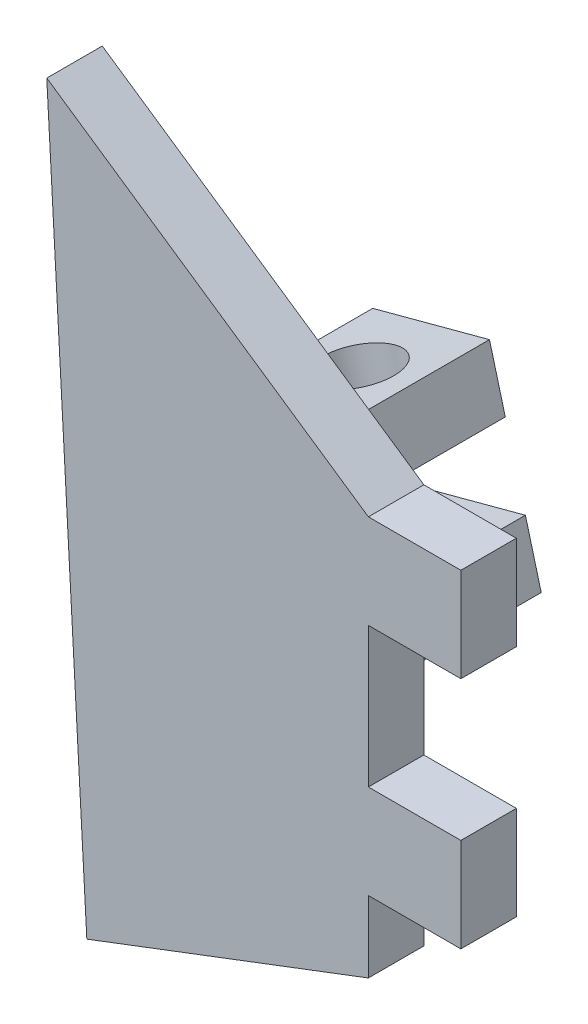
ISO-10303-21;
HEADER;
FILE_DESCRIPTION(('STEP AP214'),'2;1');
FILE_NAME('part.step','',(''),(''),'','','');
FILE_SCHEMA(('AUTOMOTIVE_DESIGN { 1 0 10303 214 1 1 1 1 }'));
ENDSEC;
DATA;
#1=APPLICATION_CONTEXT('core data for automotive mechanical design processes');
#2=APPLICATION_PROTOCOL_DEFINITION('international standard','automotive_design',2000,#1);
#3=PRODUCT_CONTEXT('',#1,'mechanical');
#4=PRODUCT('Part','Part','',(#3));
#5=PRODUCT_RELATED_PRODUCT_CATEGORY('part','',(#4));
#6=PRODUCT_DEFINITION_FORMATION('','',#4);
#7=PRODUCT_DEFINITION_CONTEXT('part definition',#1,'design');
#8=PRODUCT_DEFINITION('design','',#6,#7);
#9=PRODUCT_DEFINITION_SHAPE('','',#8);
#10=(LENGTH_UNIT() NAMED_UNIT(*) SI_UNIT(.MILLI.,.METRE.));
#11=(NAMED_UNIT(*) PLANE_ANGLE_UNIT() SI_UNIT($,.RADIAN.));
#12=(NAMED_UNIT(*) SI_UNIT($,.STERADIAN.) SOLID_ANGLE_UNIT());
#13=UNCERTAINTY_MEASURE_WITH_UNIT(LENGTH_MEASURE(1.E-05),#10,'distance_accuracy_value','');
#14=(GEOMETRIC_REPRESENTATION_CONTEXT(3) GLOBAL_UNCERTAINTY_ASSIGNED_CONTEXT((#13)) GLOBAL_UNIT_ASSIGNED_CONTEXT((#10,
#11,#12)) REPRESENTATION_CONTEXT('',''));
#15=CARTESIAN_POINT('',(0.,0.,0.));
#16=DIRECTION('',(0.,0.,1.));
#17=DIRECTION('',(1.,0.,0.));
#18=AXIS2_PLACEMENT_3D('',#15,#16,#17);
#19=CARTESIAN_POINT('',(0.,0.,0.));
#20=DIRECTION('',(0.,0.,1.));
#21=DIRECTION('',(1.,0.,0.));
#22=AXIS2_PLACEMENT_3D('',#19,#20,#21);
#23=PLANE('',#22);
#24=DIRECTION('',(-0.965925826289069,-0.258819045102518,0.));
#25=VECTOR('',#24,1.);
#26=CARTESIAN_POINT('',(1.3093957835521,29.6760159048987,0.));
#27=LINE('',#26,#25);
#28=CARTESIAN_POINT('',(7.62203706146039,31.3674830374216,0.));
#29=VERTEX_POINT('',#28);
#30=CARTESIAN_POINT('',(1.3093957835521,29.6760159048987,0.));
#31=VERTEX_POINT('',#30);
#32=EDGE_CURVE('E189',#29,#31,#27,.T.);
#33=ORIENTED_EDGE('',*,*,#32,.F.);
#34=DIRECTION('',(0.258819045102518,-0.965925826289069,0.));
#35=VECTOR('',#34,1.);
#36=CARTESIAN_POINT('',(7.62203706146039,31.3674830374216,0.));
#37=LINE('',#36,#35);
#38=CARTESIAN_POINT('',(6.76661925482987,34.5599457534659,0.));
#39=VERTEX_POINT('',#38);
#40=EDGE_CURVE('E202',#39,#29,#37,.T.);
#41=ORIENTED_EDGE('',*,*,#40,.F.);
#42=DIRECTION('',(0.965925826289069,0.258819045102518,0.));
#43=VECTOR('',#42,1.);
#44=CARTESIAN_POINT('',(6.76661925482987,34.5599457534659,0.));
#45=LINE('',#44,#43);
#46=CARTESIAN_POINT('',(0.453977976921569,32.868478620943,0.));
#47=VERTEX_POINT('',#46);
#48=EDGE_CURVE('E211',#47,#39,#45,.T.);
#49=ORIENTED_EDGE('',*,*,#48,.F.);
#50=DIRECTION('',(-0.258819045102518,0.965925826289069,0.));
#51=VECTOR('',#50,1.);
#52=CARTESIAN_POINT('',(0.453977976921569,32.868478620943,0.));
#53=LINE('',#52,#51);
#54=EDGE_CURVE('E192',#31,#47,#53,.T.);
#55=ORIENTED_EDGE('',*,*,#54,.F.);
#56=EDGE_LOOP('',(#33,#41,#49,#55));
#57=FACE_BOUND('',#56,.T.);
#58=DIRECTION('',(-0.826285867001077,0.563250979576847,0.));
#59=VECTOR('',#58,1.);
#60=CARTESIAN_POINT('',(15.2195193965159,37.9893515063543,0.));
#61=LINE('',#60,#59);
#62=CARTESIAN_POINT('',(15.2195193965159,37.9893515063543,0.));
#63=VERTEX_POINT('',#62);
#64=CARTESIAN_POINT('',(-2.16597928326462,49.8404548023103,0.));
#65=VERTEX_POINT('',#64);
#66=EDGE_CURVE('E227',#63,#65,#61,.T.);
#67=ORIENTED_EDGE('',*,*,#66,.F.);
#68=DIRECTION('',(-1.,0.,0.));
#69=VECTOR('',#68,1.);
#70=CARTESIAN_POINT('',(15.2195193965159,37.9893515063543,0.));
#71=LINE('',#70,#69);
#72=CARTESIAN_POINT('',(20.2195193965159,37.9893515063543,0.));
#73=VERTEX_POINT('',#72);
#74=EDGE_CURVE('E232',#73,#63,#71,.T.);
#75=ORIENTED_EDGE('',*,*,#74,.F.);
#76=DIRECTION('',(0.,1.,0.));
#77=VECTOR('',#76,1.);
#78=CARTESIAN_POINT('',(20.2195193965159,37.9893515063543,0.));
#79=LINE('',#78,#77);
#80=CARTESIAN_POINT('',(20.2195193965159,32.9093515063543,0.));
#81=VERTEX_POINT('',#80);
#82=EDGE_CURVE('E271',#81,#73,#79,.T.);
#83=ORIENTED_EDGE('',*,*,#82,.F.);
#84=DIRECTION('',(1.,0.,0.));
#85=VECTOR('',#84,1.);
#86=CARTESIAN_POINT('',(15.2195193965159,32.9093515063543,0.));
#87=LINE('',#86,#85);
#88=CARTESIAN_POINT('',(15.2195193965159,32.9093515063543,0.));
#89=VERTEX_POINT('',#88);
#90=EDGE_CURVE('E269',#89,#81,#87,.T.);
#91=ORIENTED_EDGE('',*,*,#90,.F.);
#92=DIRECTION('',(0.,1.,0.));
#93=VECTOR('',#92,1.);
#94=CARTESIAN_POINT('',(15.2195193965159,32.9093515063543,0.));
#95=LINE('',#94,#93);
#96=CARTESIAN_POINT('',(15.2195193965159,25.3411570874817,0.));
#97=VERTEX_POINT('',#96);
#98=EDGE_CURVE('E267',#97,#89,#95,.T.);
#99=ORIENTED_EDGE('',*,*,#98,.F.);
#100=DIRECTION('',(-1.,0.,0.));
#101=VECTOR('',#100,1.);
#102=CARTESIAN_POINT('',(15.2195193965159,25.3411570874817,0.));
#103=LINE('',#102,#101);
#104=CARTESIAN_POINT('',(20.2195193965159,25.3411570874817,0.));
#105=VERTEX_POINT('',#104);
#106=EDGE_CURVE('E265',#105,#97,#103,.T.);
#107=ORIENTED_EDGE('',*,*,#106,.F.);
#108=DIRECTION('',(0.,1.,0.));
#109=VECTOR('',#108,1.);
#110=CARTESIAN_POINT('',(20.2195193965159,25.3411570874817,0.));
#111=LINE('',#110,#109);
#112=CARTESIAN_POINT('',(20.2195193965159,20.2611570874817,0.));
#113=VERTEX_POINT('',#112);
#114=EDGE_CURVE('E263',#113,#105,#111,.T.);
#115=ORIENTED_EDGE('',*,*,#114,.F.);
#116=DIRECTION('',(1.,0.,0.));
#117=VECTOR('',#116,1.);
#118=CARTESIAN_POINT('',(15.2195193965159,20.2611570874817,0.));
#119=LINE('',#118,#117);
#120=CARTESIAN_POINT('',(15.2195193965159,20.2611570874817,0.));
#121=VERTEX_POINT('',#120);
#122=EDGE_CURVE('E261',#121,#113,#119,.T.);
#123=ORIENTED_EDGE('',*,*,#122,.F.);
#124=DIRECTION('',(0.,1.,0.));
#125=VECTOR('',#124,1.);
#126=CARTESIAN_POINT('',(15.2195193965159,20.2611570874817,0.));
#127=LINE('',#126,#125);
#128=CARTESIAN_POINT('',(15.2195193965159,16.3993515063543,0.));
#129=VERTEX_POINT('',#128);
#130=EDGE_CURVE('E259',#129,#121,#127,.T.);
#131=ORIENTED_EDGE('',*,*,#130,.F.);
#132=DIRECTION('',(0.934655278359338,0.355555214608123,0.));
#133=VECTOR('',#132,1.);
#134=CARTESIAN_POINT('',(15.2195193965159,16.3993515063543,0.));
#135=LINE('',#134,#133);
#136=CARTESIAN_POINT('',(0.,10.6096452793059,0.));
#137=VERTEX_POINT('',#136);
#138=EDGE_CURVE('E257',#137,#129,#135,.T.);
#139=ORIENTED_EDGE('',*,*,#138,.F.);
#140=DIRECTION('',(0.0551272224098083,-0.998479338468944,0.));
#141=VECTOR('',#140,1.);
#142=CARTESIAN_POINT('',(-2.16597928326462,49.8404548023103,0.));
#143=LINE('',#142,#141);
#144=EDGE_CURVE('E255',#65,#137,#143,.T.);
#145=ORIENTED_EDGE('',*,*,#144,.F.);
#146=EDGE_LOOP('',(#67,#75,#83,#91,#99,#107,#115,#123,#131,#139,#145));
#147=FACE_BOUND('',#146,.T.);
#148=DIRECTION('',(0.258819045102517,-0.965925826289069,0.));
#149=VECTOR('',#148,1.);
#150=CARTESIAN_POINT('',(8.70907705089096,27.3105945670075,0.));
#151=LINE('',#150,#149);
#152=CARTESIAN_POINT('',(8.70907705089096,27.3105945670075,0.));
#153=VERTEX_POINT('',#152);
#154=CARTESIAN_POINT('',(9.56449485752149,24.1181318509632,0.));
#155=VERTEX_POINT('',#154);
#156=EDGE_CURVE('E188',#153,#155,#151,.T.);
#157=ORIENTED_EDGE('',*,*,#156,.F.);
#158=DIRECTION('',(0.965925826289069,0.258819045102518,0.));
#159=VECTOR('',#158,1.);
#160=CARTESIAN_POINT('',(8.70907705089096,27.3105945670075,0.));
#161=LINE('',#160,#159);
#162=CARTESIAN_POINT('',(2.39643577298267,25.6191274344846,0.));
#163=VERTEX_POINT('',#162);
#164=EDGE_CURVE('E185',#163,#153,#161,.T.);
#165=ORIENTED_EDGE('',*,*,#164,.F.);
#166=DIRECTION('',(-0.258819045102518,0.965925826289069,0.));
#167=VECTOR('',#166,1.);
#168=CARTESIAN_POINT('',(2.39643577298267,25.6191274344846,0.));
#169=LINE('',#168,#167);
#170=CARTESIAN_POINT('',(3.2518535796132,22.4266647184403,0.));
#171=VERTEX_POINT('',#170);
#172=EDGE_CURVE('E57',#171,#163,#169,.T.);
#173=ORIENTED_EDGE('',*,*,#172,.F.);
#174=DIRECTION('',(-0.965925826289069,-0.258819045102518,0.));
#175=VECTOR('',#174,1.);
#176=CARTESIAN_POINT('',(3.2518535796132,22.4266647184403,0.));
#177=LINE('',#176,#175);
#178=EDGE_CURVE('E52',#155,#171,#177,.T.);
#179=ORIENTED_EDGE('',*,*,#178,.F.);
#180=EDGE_LOOP('',(#157,#165,#173,#179));
#181=FACE_BOUND('',#180,.T.);
#182=ADVANCED_FACE('F36',(#57,#147,#181),#23,.F.);
#183=CARTESIAN_POINT('',(15.2195193965159,37.9893515063543,3.));
#184=DIRECTION('',(-0.563250979576847,-0.826285867001077,0.));
#185=DIRECTION('',(0.826285867001077,-0.563250979576847,0.));
#186=AXIS2_PLACEMENT_3D('',#183,#184,#185);
#187=PLANE('',#186);
#188=ORIENTED_EDGE('',*,*,#66,.T.);
#189=DIRECTION('',(0.,0.,-1.));
#190=VECTOR('',#189,1.);
#191=CARTESIAN_POINT('',(-2.16597928326462,49.8404548023103,3.));
#192=LINE('',#191,#190);
#193=CARTESIAN_POINT('',(-2.16597928326462,49.8404548023103,3.));
#194=VERTEX_POINT('',#193);
#195=EDGE_CURVE('E11',#194,#65,#192,.T.);
#196=ORIENTED_EDGE('',*,*,#195,.F.);
#197=DIRECTION('',(-0.826285867001077,0.563250979576847,0.));
#198=VECTOR('',#197,1.);
#199=CARTESIAN_POINT('',(15.2195193965159,37.9893515063543,3.));
#200=LINE('',#199,#198);
#201=CARTESIAN_POINT('',(15.2195193965159,37.9893515063543,3.));
#202=VERTEX_POINT('',#201);
#203=EDGE_CURVE('E228',#202,#194,#200,.T.);
#204=ORIENTED_EDGE('',*,*,#203,.F.);
#205=DIRECTION('',(0.,0.,-1.));
#206=VECTOR('',#205,1.);
#207=CARTESIAN_POINT('',(15.2195193965159,37.9893515063543,3.));
#208=LINE('',#207,#206);
#209=EDGE_CURVE('E252',#202,#63,#208,.T.);
#210=ORIENTED_EDGE('',*,*,#209,.T.);
#211=EDGE_LOOP('',(#188,#196,#204,#210));
#212=FACE_BOUND('',#211,.T.);
#213=ADVANCED_FACE('F38',(#212),#187,.F.);
#214=CARTESIAN_POINT('',(-2.16597928326462,49.8404548023103,3.));
#215=DIRECTION('',(0.998479338468944,0.0551272224098083,0.));
#216=DIRECTION('',(-0.0551272224098083,0.998479338468944,0.));
#217=AXIS2_PLACEMENT_3D('',#214,#215,#216);
#218=PLANE('',#217);
#219=ORIENTED_EDGE('',*,*,#144,.T.);
#220=DIRECTION('',(0.,0.,-1.));
#221=VECTOR('',#220,1.);
#222=CARTESIAN_POINT('',(0.,10.6096452793059,3.));
#223=LINE('',#222,#221);
#224=CARTESIAN_POINT('',(0.,10.6096452793059,3.));
#225=VERTEX_POINT('',#224);
#226=EDGE_CURVE('E45',#225,#137,#223,.T.);
#227=ORIENTED_EDGE('',*,*,#226,.F.);
#228=DIRECTION('',(0.0551272224098083,-0.998479338468944,0.));
#229=VECTOR('',#228,1.);
#230=CARTESIAN_POINT('',(-2.16597928326462,49.8404548023103,3.));
#231=LINE('',#230,#229);
#232=EDGE_CURVE('E231',#194,#225,#231,.T.);
#233=ORIENTED_EDGE('',*,*,#232,.F.);
#234=ORIENTED_EDGE('',*,*,#195,.T.);
#235=EDGE_LOOP('',(#219,#227,#233,#234));
#236=FACE_BOUND('',#235,.T.);
#237=ADVANCED_FACE('F327',(#236),#218,.F.);
#238=CARTESIAN_POINT('',(15.2195193965159,16.3993515063543,3.));
#239=DIRECTION('',(-0.355555214608123,0.934655278359338,0.));
#240=DIRECTION('',(-0.934655278359338,-0.355555214608123,0.));
#241=AXIS2_PLACEMENT_3D('',#238,#239,#240);
#242=PLANE('',#241);
#243=ORIENTED_EDGE('',*,*,#138,.T.);
#244=DIRECTION('',(0.,0.,-1.));
#245=VECTOR('',#244,1.);
#246=CARTESIAN_POINT('',(15.2195193965159,16.3993515063543,3.));
#247=LINE('',#246,#245);
#248=CARTESIAN_POINT('',(15.2195193965159,16.3993515063543,3.));
#249=VERTEX_POINT('',#248);
#250=EDGE_CURVE('E297',#249,#129,#247,.T.);
#251=ORIENTED_EDGE('',*,*,#250,.F.);
#252=DIRECTION('',(0.934655278359338,0.355555214608123,0.));
#253=VECTOR('',#252,1.);
#254=CARTESIAN_POINT('',(15.2195193965159,16.3993515063543,3.));
#255=LINE('',#254,#253);
#256=EDGE_CURVE('E234',#225,#249,#255,.T.);
#257=ORIENTED_EDGE('',*,*,#256,.F.);
#258=ORIENTED_EDGE('',*,*,#226,.T.);
#259=EDGE_LOOP('',(#243,#251,#257,#258));
#260=FACE_BOUND('',#259,.T.);
#261=ADVANCED_FACE('F305',(#260),#242,.F.);
#262=CARTESIAN_POINT('',(15.2195193965159,20.2611570874817,3.));
#263=DIRECTION('',(-1.,0.,0.));
#264=DIRECTION('',(0.,0.,1.));
#265=AXIS2_PLACEMENT_3D('',#262,#263,#264);
#266=PLANE('',#265);
#267=ORIENTED_EDGE('',*,*,#130,.T.);
#268=DIRECTION('',(0.,0.,-1.));
#269=VECTOR('',#268,1.);
#270=CARTESIAN_POINT('',(15.2195193965159,20.2611570874817,3.));
#271=LINE('',#270,#269);
#272=CARTESIAN_POINT('',(15.2195193965159,20.2611570874817,3.));
#273=VERTEX_POINT('',#272);
#274=EDGE_CURVE('E294',#273,#121,#271,.T.);
#275=ORIENTED_EDGE('',*,*,#274,.F.);
#276=DIRECTION('',(0.,1.,0.));
#277=VECTOR('',#276,1.);
#278=CARTESIAN_POINT('',(15.2195193965159,20.2611570874817,3.));
#279=LINE('',#278,#277);
#280=EDGE_CURVE('E236',#249,#273,#279,.T.);
#281=ORIENTED_EDGE('',*,*,#280,.F.);
#282=ORIENTED_EDGE('',*,*,#250,.T.);
#283=EDGE_LOOP('',(#267,#275,#281,#282));
#284=FACE_BOUND('',#283,.T.);
#285=ADVANCED_FACE('F315',(#284),#266,.F.);
#286=CARTESIAN_POINT('',(15.2195193965159,20.2611570874817,3.));
#287=DIRECTION('',(0.,1.,0.));
#288=DIRECTION('',(0.,0.,1.));
#289=AXIS2_PLACEMENT_3D('',#286,#287,#288);
#290=PLANE('',#289);
#291=ORIENTED_EDGE('',*,*,#122,.T.);
#292=DIRECTION('',(0.,0.,-1.));
#293=VECTOR('',#292,1.);
#294=CARTESIAN_POINT('',(20.2195193965159,20.2611570874817,3.));
#295=LINE('',#294,#293);
#296=CARTESIAN_POINT('',(20.2195193965159,20.2611570874817,3.));
#297=VERTEX_POINT('',#296);
#298=EDGE_CURVE('E291',#297,#113,#295,.T.);
#299=ORIENTED_EDGE('',*,*,#298,.F.);
#300=DIRECTION('',(1.,0.,0.));
#301=VECTOR('',#300,1.);
#302=CARTESIAN_POINT('',(15.2195193965159,20.2611570874817,3.));
#303=LINE('',#302,#301);
#304=EDGE_CURVE('E238',#273,#297,#303,.T.);
#305=ORIENTED_EDGE('',*,*,#304,.F.);
#306=ORIENTED_EDGE('',*,*,#274,.T.);
#307=EDGE_LOOP('',(#291,#299,#305,#306));
#308=FACE_BOUND('',#307,.T.);
#309=ADVANCED_FACE('F319',(#308),#290,.F.);
#310=CARTESIAN_POINT('',(20.2195193965159,25.3411570874817,3.));
#311=DIRECTION('',(-1.,0.,0.));
#312=DIRECTION('',(0.,0.,1.));
#313=AXIS2_PLACEMENT_3D('',#310,#311,#312);
#314=PLANE('',#313);
#315=ORIENTED_EDGE('',*,*,#114,.T.);
#316=DIRECTION('',(0.,0.,-1.));
#317=VECTOR('',#316,1.);
#318=CARTESIAN_POINT('',(20.2195193965159,25.3411570874817,3.));
#319=LINE('',#318,#317);
#320=CARTESIAN_POINT('',(20.2195193965159,25.3411570874817,3.));
#321=VERTEX_POINT('',#320);
#322=EDGE_CURVE('E288',#321,#105,#319,.T.);
#323=ORIENTED_EDGE('',*,*,#322,.F.);
#324=DIRECTION('',(0.,1.,0.));
#325=VECTOR('',#324,1.);
#326=CARTESIAN_POINT('',(20.2195193965159,25.3411570874817,3.));
#327=LINE('',#326,#325);
#328=EDGE_CURVE('E240',#297,#321,#327,.T.);
#329=ORIENTED_EDGE('',*,*,#328,.F.);
#330=ORIENTED_EDGE('',*,*,#298,.T.);
#331=EDGE_LOOP('',(#315,#323,#329,#330));
#332=FACE_BOUND('',#331,.T.);
#333=ADVANCED_FACE('F355',(#332),#314,.F.);
#334=CARTESIAN_POINT('',(15.2195193965159,25.3411570874817,3.));
#335=DIRECTION('',(0.,-1.,0.));
#336=DIRECTION('',(0.,0.,-1.));
#337=AXIS2_PLACEMENT_3D('',#334,#335,#336);
#338=PLANE('',#337);
#339=ORIENTED_EDGE('',*,*,#106,.T.);
#340=DIRECTION('',(0.,0.,-1.));
#341=VECTOR('',#340,1.);
#342=CARTESIAN_POINT('',(15.2195193965159,25.3411570874817,3.));
#343=LINE('',#342,#341);
#344=CARTESIAN_POINT('',(15.2195193965159,25.3411570874817,3.));
#345=VERTEX_POINT('',#344);
#346=EDGE_CURVE('E285',#345,#97,#343,.T.);
#347=ORIENTED_EDGE('',*,*,#346,.F.);
#348=DIRECTION('',(-1.,0.,0.));
#349=VECTOR('',#348,1.);
#350=CARTESIAN_POINT('',(15.2195193965159,25.3411570874817,3.));
#351=LINE('',#350,#349);
#352=EDGE_CURVE('E242',#321,#345,#351,.T.);
#353=ORIENTED_EDGE('',*,*,#352,.F.);
#354=ORIENTED_EDGE('',*,*,#322,.T.);
#355=EDGE_LOOP('',(#339,#347,#353,#354));
#356=FACE_BOUND('',#355,.T.);
#357=ADVANCED_FACE('F353',(#356),#338,.F.);
#358=CARTESIAN_POINT('',(15.2195193965159,32.9093515063543,3.));
#359=DIRECTION('',(-1.,0.,0.));
#360=DIRECTION('',(0.,0.,1.));
#361=AXIS2_PLACEMENT_3D('',#358,#359,#360);
#362=PLANE('',#361);
#363=ORIENTED_EDGE('',*,*,#98,.T.);
#364=DIRECTION('',(0.,0.,-1.));
#365=VECTOR('',#364,1.);
#366=CARTESIAN_POINT('',(15.2195193965159,32.9093515063543,3.));
#367=LINE('',#366,#365);
#368=CARTESIAN_POINT('',(15.2195193965159,32.9093515063543,3.));
#369=VERTEX_POINT('',#368);
#370=EDGE_CURVE('E282',#369,#89,#367,.T.);
#371=ORIENTED_EDGE('',*,*,#370,.F.);
#372=DIRECTION('',(0.,1.,0.));
#373=VECTOR('',#372,1.);
#374=CARTESIAN_POINT('',(15.2195193965159,32.9093515063543,3.));
#375=LINE('',#374,#373);
#376=EDGE_CURVE('E244',#345,#369,#375,.T.);
#377=ORIENTED_EDGE('',*,*,#376,.F.);
#378=ORIENTED_EDGE('',*,*,#346,.T.);
#379=EDGE_LOOP('',(#363,#371,#377,#378));
#380=FACE_BOUND('',#379,.T.);
#381=ADVANCED_FACE('F348',(#380),#362,.F.);
#382=CARTESIAN_POINT('',(15.2195193965159,32.9093515063543,3.));
#383=DIRECTION('',(0.,1.,0.));
#384=DIRECTION('',(0.,0.,1.));
#385=AXIS2_PLACEMENT_3D('',#382,#383,#384);
#386=PLANE('',#385);
#387=ORIENTED_EDGE('',*,*,#90,.T.);
#388=DIRECTION('',(0.,0.,-1.));
#389=VECTOR('',#388,1.);
#390=CARTESIAN_POINT('',(20.2195193965159,32.9093515063543,3.));
#391=LINE('',#390,#389);
#392=CARTESIAN_POINT('',(20.2195193965159,32.9093515063543,3.));
#393=VERTEX_POINT('',#392);
#394=EDGE_CURVE('E279',#393,#81,#391,.T.);
#395=ORIENTED_EDGE('',*,*,#394,.F.);
#396=DIRECTION('',(1.,0.,0.));
#397=VECTOR('',#396,1.);
#398=CARTESIAN_POINT('',(15.2195193965159,32.9093515063543,3.));
#399=LINE('',#398,#397);
#400=EDGE_CURVE('E246',#369,#393,#399,.T.);
#401=ORIENTED_EDGE('',*,*,#400,.F.);
#402=ORIENTED_EDGE('',*,*,#370,.T.);
#403=EDGE_LOOP('',(#387,#395,#401,#402));
#404=FACE_BOUND('',#403,.T.);
#405=ADVANCED_FACE('F343',(#404),#386,.F.);
#406=CARTESIAN_POINT('',(20.2195193965159,37.9893515063543,3.));
#407=DIRECTION('',(-1.,0.,0.));
#408=DIRECTION('',(0.,0.,1.));
#409=AXIS2_PLACEMENT_3D('',#406,#407,#408);
#410=PLANE('',#409);
#411=ORIENTED_EDGE('',*,*,#82,.T.);
#412=DIRECTION('',(0.,0.,-1.));
#413=VECTOR('',#412,1.);
#414=CARTESIAN_POINT('',(20.2195193965159,37.9893515063543,3.));
#415=LINE('',#414,#413);
#416=CARTESIAN_POINT('',(20.2195193965159,37.9893515063543,3.));
#417=VERTEX_POINT('',#416);
#418=EDGE_CURVE('E276',#417,#73,#415,.T.);
#419=ORIENTED_EDGE('',*,*,#418,.F.);
#420=DIRECTION('',(0.,1.,0.));
#421=VECTOR('',#420,1.);
#422=CARTESIAN_POINT('',(20.2195193965159,37.9893515063543,3.));
#423=LINE('',#422,#421);
#424=EDGE_CURVE('E248',#393,#417,#423,.T.);
#425=ORIENTED_EDGE('',*,*,#424,.F.);
#426=ORIENTED_EDGE('',*,*,#394,.T.);
#427=EDGE_LOOP('',(#411,#419,#425,#426));
#428=FACE_BOUND('',#427,.T.);
#429=ADVANCED_FACE('F339',(#428),#410,.F.);
#430=CARTESIAN_POINT('',(15.2195193965159,37.9893515063543,3.));
#431=DIRECTION('',(0.,-1.,0.));
#432=DIRECTION('',(0.,0.,-1.));
#433=AXIS2_PLACEMENT_3D('',#430,#431,#432);
#434=PLANE('',#433);
#435=ORIENTED_EDGE('',*,*,#74,.T.);
#436=ORIENTED_EDGE('',*,*,#209,.F.);
#437=DIRECTION('',(-1.,0.,0.));
#438=VECTOR('',#437,1.);
#439=CARTESIAN_POINT('',(15.2195193965159,37.9893515063543,3.));
#440=LINE('',#439,#438);
#441=EDGE_CURVE('E250',#417,#202,#440,.T.);
#442=ORIENTED_EDGE('',*,*,#441,.F.);
#443=ORIENTED_EDGE('',*,*,#418,.T.);
#444=EDGE_LOOP('',(#435,#436,#442,#443));
#445=FACE_BOUND('',#444,.T.);
#446=ADVANCED_FACE('F334',(#445),#434,.F.);
#447=CARTESIAN_POINT('',(0.,0.,3.));
#448=DIRECTION('',(0.,0.,1.));
#449=DIRECTION('',(1.,0.,0.));
#450=AXIS2_PLACEMENT_3D('',#447,#448,#449);
#451=PLANE('',#450);
#452=ORIENTED_EDGE('',*,*,#203,.T.);
#453=ORIENTED_EDGE('',*,*,#232,.T.);
#454=ORIENTED_EDGE('',*,*,#256,.T.);
#455=ORIENTED_EDGE('',*,*,#280,.T.);
#456=ORIENTED_EDGE('',*,*,#304,.T.);
#457=ORIENTED_EDGE('',*,*,#328,.T.);
#458=ORIENTED_EDGE('',*,*,#352,.T.);
#459=ORIENTED_EDGE('',*,*,#376,.T.);
#460=ORIENTED_EDGE('',*,*,#400,.T.);
#461=ORIENTED_EDGE('',*,*,#424,.T.);
#462=ORIENTED_EDGE('',*,*,#441,.T.);
#463=EDGE_LOOP('',(#452,#453,#454,#455,#456,#457,#458,#459,#460,#461,#462));
#464=FACE_BOUND('',#463,.T.);
#465=ADVANCED_FACE('F323',(#464),#451,.T.);
#466=CARTESIAN_POINT('',(1.3093957835521,29.6760159048987,-12.));
#467=DIRECTION('',(-0.258819045102518,0.965925826289069,0.));
#468=DIRECTION('',(-0.965925826289069,-0.258819045102518,0.));
#469=AXIS2_PLACEMENT_3D('',#466,#467,#468);
#470=PLANE('',#469);
#471=CARTESIAN_POINT('',(4.46571642250624,30.5217494711601,-8.04439772308612));
#472=DIRECTION('',(-0.258819045102518,0.965925826289069,0.));
#473=DIRECTION('',(-0.965925826289069,-0.258819045102518,0.));
#474=AXIS2_PLACEMENT_3D('',#471,#472,#473);
#475=CIRCLE('',#474,2.);
#476=CARTESIAN_POINT('',(2.53386476992811,30.0041113809551,-8.04439772308612));
#477=VERTEX_POINT('',#476);
#478=EDGE_CURVE('E579',#477,#477,#475,.T.);
#479=ORIENTED_EDGE('',*,*,#478,.T.);
#480=EDGE_LOOP('',(#479));
#481=FACE_BOUND('',#480,.T.);
#482=ORIENTED_EDGE('',*,*,#32,.T.);
#483=DIRECTION('',(0.,0.,1.));
#484=VECTOR('',#483,1.);
#485=CARTESIAN_POINT('',(1.3093957835521,29.6760159048987,-12.));
#486=LINE('',#485,#484);
#487=CARTESIAN_POINT('',(1.3093957835521,29.6760159048987,-12.));
#488=VERTEX_POINT('',#487);
#489=EDGE_CURVE('E224',#488,#31,#486,.T.);
#490=ORIENTED_EDGE('',*,*,#489,.F.);
#491=DIRECTION('',(-0.965925826289069,-0.258819045102518,0.));
#492=VECTOR('',#491,1.);
#493=CARTESIAN_POINT('',(1.3093957835521,29.6760159048987,-12.));
#494=LINE('',#493,#492);
#495=CARTESIAN_POINT('',(7.62203706146039,31.3674830374216,-12.));
#496=VERTEX_POINT('',#495);
#497=EDGE_CURVE('E198',#496,#488,#494,.T.);
#498=ORIENTED_EDGE('',*,*,#497,.F.);
#499=DIRECTION('',(0.,0.,1.));
#500=VECTOR('',#499,1.);
#501=CARTESIAN_POINT('',(7.62203706146039,31.3674830374216,-12.));
#502=LINE('',#501,#500);
#503=EDGE_CURVE('E207',#496,#29,#502,.T.);
#504=ORIENTED_EDGE('',*,*,#503,.T.);
#505=EDGE_LOOP('',(#482,#490,#498,#504));
#506=FACE_BOUND('',#505,.T.);
#507=ADVANCED_FACE('F402',(#481,#506),#470,.F.);
#508=CARTESIAN_POINT('',(0.453977976921569,32.868478620943,-12.));
#509=DIRECTION('',(0.965925826289069,0.258819045102518,0.));
#510=DIRECTION('',(-0.258819045102518,0.965925826289069,0.));
#511=AXIS2_PLACEMENT_3D('',#508,#509,#510);
#512=PLANE('',#511);
#513=ORIENTED_EDGE('',*,*,#54,.T.);
#514=DIRECTION('',(0.,0.,1.));
#515=VECTOR('',#514,1.);
#516=CARTESIAN_POINT('',(0.453977976921569,32.868478620943,-12.));
#517=LINE('',#516,#515);
#518=CARTESIAN_POINT('',(0.453977976921569,32.868478620943,-12.));
#519=VERTEX_POINT('',#518);
#520=EDGE_CURVE('E221',#519,#47,#517,.T.);
#521=ORIENTED_EDGE('',*,*,#520,.F.);
#522=DIRECTION('',(-0.258819045102518,0.965925826289069,0.));
#523=VECTOR('',#522,1.);
#524=CARTESIAN_POINT('',(0.453977976921569,32.868478620943,-12.));
#525=LINE('',#524,#523);
#526=EDGE_CURVE('E201',#488,#519,#525,.T.);
#527=ORIENTED_EDGE('',*,*,#526,.F.);
#528=ORIENTED_EDGE('',*,*,#489,.T.);
#529=EDGE_LOOP('',(#513,#521,#527,#528));
#530=FACE_BOUND('',#529,.T.);
#531=ADVANCED_FACE('F408',(#530),#512,.F.);
#532=CARTESIAN_POINT('',(6.76661925482987,34.5599457534659,-12.));
#533=DIRECTION('',(0.258819045102518,-0.965925826289069,0.));
#534=DIRECTION('',(0.965925826289069,0.258819045102518,0.));
#535=AXIS2_PLACEMENT_3D('',#532,#533,#534);
#536=PLANE('',#535);
#537=CARTESIAN_POINT('',(3.61029861587571,33.7142121872045,-8.04439772308612));
#538=DIRECTION('',(-0.258819045102519,0.965925826289069,0.));
#539=DIRECTION('',(-0.965925826289069,-0.258819045102519,0.));
#540=AXIS2_PLACEMENT_3D('',#537,#538,#539);
#541=CIRCLE('',#540,2.);
#542=CARTESIAN_POINT('',(1.67844696329758,33.1965740969994,-8.04439772308612));
#543=VERTEX_POINT('',#542);
#544=EDGE_CURVE('E576',#543,#543,#541,.T.);
#545=ORIENTED_EDGE('',*,*,#544,.F.);
#546=EDGE_LOOP('',(#545));
#547=FACE_BOUND('',#546,.T.);
#548=ORIENTED_EDGE('',*,*,#48,.T.);
#549=DIRECTION('',(0.,0.,1.));
#550=VECTOR('',#549,1.);
#551=CARTESIAN_POINT('',(6.76661925482987,34.5599457534659,-12.));
#552=LINE('',#551,#550);
#553=CARTESIAN_POINT('',(6.76661925482987,34.5599457534659,-12.));
#554=VERTEX_POINT('',#553);
#555=EDGE_CURVE('E218',#554,#39,#552,.T.);
#556=ORIENTED_EDGE('',*,*,#555,.F.);
#557=DIRECTION('',(0.965925826289069,0.258819045102518,0.));
#558=VECTOR('',#557,1.);
#559=CARTESIAN_POINT('',(6.76661925482987,34.5599457534659,-12.));
#560=LINE('',#559,#558);
#561=EDGE_CURVE('E204',#519,#554,#560,.T.);
#562=ORIENTED_EDGE('',*,*,#561,.F.);
#563=ORIENTED_EDGE('',*,*,#520,.T.);
#564=EDGE_LOOP('',(#548,#556,#562,#563));
#565=FACE_BOUND('',#564,.T.);
#566=ADVANCED_FACE('F417',(#547,#565),#536,.F.);
#567=CARTESIAN_POINT('',(7.62203706146039,31.3674830374216,-12.));
#568=DIRECTION('',(-0.965925826289069,-0.258819045102518,0.));
#569=DIRECTION('',(0.258819045102518,-0.965925826289069,0.));
#570=AXIS2_PLACEMENT_3D('',#567,#568,#569);
#571=PLANE('',#570);
#572=ORIENTED_EDGE('',*,*,#40,.T.);
#573=ORIENTED_EDGE('',*,*,#503,.F.);
#574=DIRECTION('',(0.258819045102518,-0.965925826289069,0.));
#575=VECTOR('',#574,1.);
#576=CARTESIAN_POINT('',(7.62203706146039,31.3674830374216,-12.));
#577=LINE('',#576,#575);
#578=EDGE_CURVE('E206',#554,#496,#577,.T.);
#579=ORIENTED_EDGE('',*,*,#578,.F.);
#580=ORIENTED_EDGE('',*,*,#555,.T.);
#581=EDGE_LOOP('',(#572,#573,#579,#580));
#582=FACE_BOUND('',#581,.T.);
#583=ADVANCED_FACE('F425',(#582),#571,.F.);
#584=CARTESIAN_POINT('',(0.,0.,-12.));
#585=DIRECTION('',(0.,0.,1.));
#586=DIRECTION('',(1.,0.,0.));
#587=AXIS2_PLACEMENT_3D('',#584,#585,#586);
#588=PLANE('',#587);
#589=ORIENTED_EDGE('',*,*,#497,.T.);
#590=ORIENTED_EDGE('',*,*,#526,.T.);
#591=ORIENTED_EDGE('',*,*,#561,.T.);
#592=ORIENTED_EDGE('',*,*,#578,.T.);
#593=EDGE_LOOP('',(#589,#590,#591,#592));
#594=FACE_BOUND('',#593,.T.);
#595=ADVANCED_FACE('F433',(#594),#588,.F.);
#596=CARTESIAN_POINT('',(8.70907705089096,27.3105945670075,-12.));
#597=DIRECTION('',(-0.965925826289069,-0.258819045102517,0.));
#598=DIRECTION('',(0.258819045102517,-0.965925826289069,0.));
#599=AXIS2_PLACEMENT_3D('',#596,#597,#598);
#600=PLANE('',#599);
#601=ORIENTED_EDGE('',*,*,#156,.T.);
#602=DIRECTION('',(0.,0.,1.));
#603=VECTOR('',#602,1.);
#604=CARTESIAN_POINT('',(9.56449485752149,24.1181318509632,-12.));
#605=LINE('',#604,#603);
#606=CARTESIAN_POINT('',(9.56449485752149,24.1181318509632,-12.));
#607=VERTEX_POINT('',#606);
#608=EDGE_CURVE('E169',#607,#155,#605,.T.);
#609=ORIENTED_EDGE('',*,*,#608,.F.);
#610=DIRECTION('',(0.258819045102517,-0.965925826289069,0.));
#611=VECTOR('',#610,1.);
#612=CARTESIAN_POINT('',(8.70907705089096,27.3105945670075,-12.));
#613=LINE('',#612,#611);
#614=CARTESIAN_POINT('',(8.70907705089096,27.3105945670075,-12.));
#615=VERTEX_POINT('',#614);
#616=EDGE_CURVE('E176',#615,#607,#613,.T.);
#617=ORIENTED_EDGE('',*,*,#616,.F.);
#618=DIRECTION('',(0.,0.,1.));
#619=VECTOR('',#618,1.);
#620=CARTESIAN_POINT('',(8.70907705089096,27.3105945670075,-12.));
#621=LINE('',#620,#619);
#622=EDGE_CURVE('E588',#615,#153,#621,.T.);
#623=ORIENTED_EDGE('',*,*,#622,.T.);
#624=EDGE_LOOP('',(#601,#609,#617,#623));
#625=FACE_BOUND('',#624,.T.);
#626=ADVANCED_FACE('F187',(#625),#600,.F.);
#627=CARTESIAN_POINT('',(3.2518535796132,22.4266647184403,-12.));
#628=DIRECTION('',(-0.258819045102518,0.965925826289069,0.));
#629=DIRECTION('',(-0.965925826289069,-0.258819045102518,0.));
#630=AXIS2_PLACEMENT_3D('',#627,#628,#629);
#631=PLANE('',#630);
#632=CARTESIAN_POINT('',(6.40817421856735,23.2723982847018,-8.04439772308612));
#633=DIRECTION('',(-0.258819045102518,0.965925826289069,0.));
#634=DIRECTION('',(-0.965925826289069,-0.258819045102518,0.));
#635=AXIS2_PLACEMENT_3D('',#632,#633,#634);
#636=CIRCLE('',#635,2.);
#637=CARTESIAN_POINT('',(4.47632256598921,22.7547601944967,-8.04439772308612));
#638=VERTEX_POINT('',#637);
#639=EDGE_CURVE('E580',#638,#638,#636,.T.);
#640=ORIENTED_EDGE('',*,*,#639,.T.);
#641=EDGE_LOOP('',(#640));
#642=FACE_BOUND('',#641,.T.);
#643=ORIENTED_EDGE('',*,*,#178,.T.);
#644=DIRECTION('',(0.,0.,1.));
#645=VECTOR('',#644,1.);
#646=CARTESIAN_POINT('',(3.2518535796132,22.4266647184403,-12.));
#647=LINE('',#646,#645);
#648=CARTESIAN_POINT('',(3.2518535796132,22.4266647184403,-12.));
#649=VERTEX_POINT('',#648);
#650=EDGE_CURVE('E172',#649,#171,#647,.T.);
#651=ORIENTED_EDGE('',*,*,#650,.F.);
#652=DIRECTION('',(-0.965925826289069,-0.258819045102518,0.));
#653=VECTOR('',#652,1.);
#654=CARTESIAN_POINT('',(3.2518535796132,22.4266647184403,-12.));
#655=LINE('',#654,#653);
#656=EDGE_CURVE('E165',#607,#649,#655,.T.);
#657=ORIENTED_EDGE('',*,*,#656,.F.);
#658=ORIENTED_EDGE('',*,*,#608,.T.);
#659=EDGE_LOOP('',(#643,#651,#657,#658));
#660=FACE_BOUND('',#659,.T.);
#661=ADVANCED_FACE('F167',(#642,#660),#631,.F.);
#662=CARTESIAN_POINT('',(2.39643577298267,25.6191274344846,-12.));
#663=DIRECTION('',(0.965925826289069,0.258819045102518,0.));
#664=DIRECTION('',(-0.258819045102518,0.965925826289069,0.));
#665=AXIS2_PLACEMENT_3D('',#662,#663,#664);
#666=PLANE('',#665);
#667=ORIENTED_EDGE('',*,*,#172,.T.);
#668=DIRECTION('',(0.,0.,1.));
#669=VECTOR('',#668,1.);
#670=CARTESIAN_POINT('',(2.39643577298267,25.6191274344846,-12.));
#671=LINE('',#670,#669);
#672=CARTESIAN_POINT('',(2.39643577298267,25.6191274344846,-12.));
#673=VERTEX_POINT('',#672);
#674=EDGE_CURVE('E194',#673,#163,#671,.T.);
#675=ORIENTED_EDGE('',*,*,#674,.F.);
#676=DIRECTION('',(-0.258819045102518,0.965925826289069,0.));
#677=VECTOR('',#676,1.);
#678=CARTESIAN_POINT('',(2.39643577298267,25.6191274344846,-12.));
#679=LINE('',#678,#677);
#680=EDGE_CURVE('E175',#649,#673,#679,.T.);
#681=ORIENTED_EDGE('',*,*,#680,.F.);
#682=ORIENTED_EDGE('',*,*,#650,.T.);
#683=EDGE_LOOP('',(#667,#675,#681,#682));
#684=FACE_BOUND('',#683,.T.);
#685=ADVANCED_FACE('F454',(#684),#666,.F.);
#686=CARTESIAN_POINT('',(8.70907705089096,27.3105945670075,-12.));
#687=DIRECTION('',(0.258819045102518,-0.965925826289069,0.));
#688=DIRECTION('',(0.965925826289069,0.258819045102518,0.));
#689=AXIS2_PLACEMENT_3D('',#686,#687,#688);
#690=PLANE('',#689);
#691=CARTESIAN_POINT('',(5.55275641193682,26.4648610007461,-8.04439772308612));
#692=DIRECTION('',(0.258819045102518,-0.965925826289069,0.));
#693=DIRECTION('',(0.965925826289069,0.258819045102518,0.));
#694=AXIS2_PLACEMENT_3D('',#691,#692,#693);
#695=CIRCLE('',#694,2.);
#696=CARTESIAN_POINT('',(7.48460806451496,26.9824990909511,-8.04439772308612));
#697=VERTEX_POINT('',#696);
#698=EDGE_CURVE('E40',#697,#697,#695,.T.);
#699=ORIENTED_EDGE('',*,*,#698,.T.);
#700=EDGE_LOOP('',(#699));
#701=FACE_BOUND('',#700,.T.);
#702=ORIENTED_EDGE('',*,*,#164,.T.);
#703=ORIENTED_EDGE('',*,*,#622,.F.);
#704=DIRECTION('',(0.965925826289069,0.258819045102518,0.));
#705=VECTOR('',#704,1.);
#706=CARTESIAN_POINT('',(8.70907705089096,27.3105945670075,-12.));
#707=LINE('',#706,#705);
#708=EDGE_CURVE('E181',#673,#615,#707,.T.);
#709=ORIENTED_EDGE('',*,*,#708,.F.);
#710=ORIENTED_EDGE('',*,*,#674,.T.);
#711=EDGE_LOOP('',(#702,#703,#709,#710));
#712=FACE_BOUND('',#711,.T.);
#713=ADVANCED_FACE('F462',(#701,#712),#690,.F.);
#714=CARTESIAN_POINT('',(0.,0.,-12.));
#715=DIRECTION('',(0.,0.,1.));
#716=DIRECTION('',(1.,0.,0.));
#717=AXIS2_PLACEMENT_3D('',#714,#715,#716);
#718=PLANE('',#717);
#719=ORIENTED_EDGE('',*,*,#616,.T.);
#720=ORIENTED_EDGE('',*,*,#656,.T.);
#721=ORIENTED_EDGE('',*,*,#680,.T.);
#722=ORIENTED_EDGE('',*,*,#708,.T.);
#723=EDGE_LOOP('',(#719,#720,#721,#722));
#724=FACE_BOUND('',#723,.T.);
#725=ADVANCED_FACE('F179',(#724),#718,.F.);
#726=CARTESIAN_POINT('',(10.499047166621,8.00505259525643,-8.04439772308612));
#727=DIRECTION('',(-0.258819045102519,0.965925826289069,0.));
#728=DIRECTION('',(-0.965925826289069,-0.258819045102519,0.));
#729=AXIS2_PLACEMENT_3D('',#726,#727,#728);
#730=CYLINDRICAL_SURFACE('',#729,2.);
#731=ORIENTED_EDGE('',*,*,#698,.F.);
#732=EDGE_LOOP('',(#731));
#733=FACE_BOUND('',#732,.T.);
#734=ORIENTED_EDGE('',*,*,#639,.F.);
#735=EDGE_LOOP('',(#734));
#736=FACE_BOUND('',#735,.T.);
#737=ADVANCED_FACE('F476',(#733,#736),#730,.F.);
#738=ORIENTED_EDGE('',*,*,#544,.T.);
#739=EDGE_LOOP('',(#738));
#740=FACE_BOUND('',#739,.T.);
#741=ORIENTED_EDGE('',*,*,#478,.F.);
#742=EDGE_LOOP('',(#741));
#743=FACE_BOUND('',#742,.T.);
#744=ADVANCED_FACE('F482',(#740,#743),#730,.F.);
#745=CLOSED_SHELL('',(#182,#213,#237,#261,#285,#309,#333,#357,#381,#405,#429,#446,#465,#507,
#531,#566,#583,#595,#626,#661,#685,#713,#725,#737,#744));
#746=MANIFOLD_SOLID_BREP('B2',#745);
#747=ADVANCED_BREP_SHAPE_REPRESENTATION('',(#18,#746),#14);
#748=SHAPE_DEFINITION_REPRESENTATION(#9,#747);
ENDSEC;
END-ISO-10303-21;
